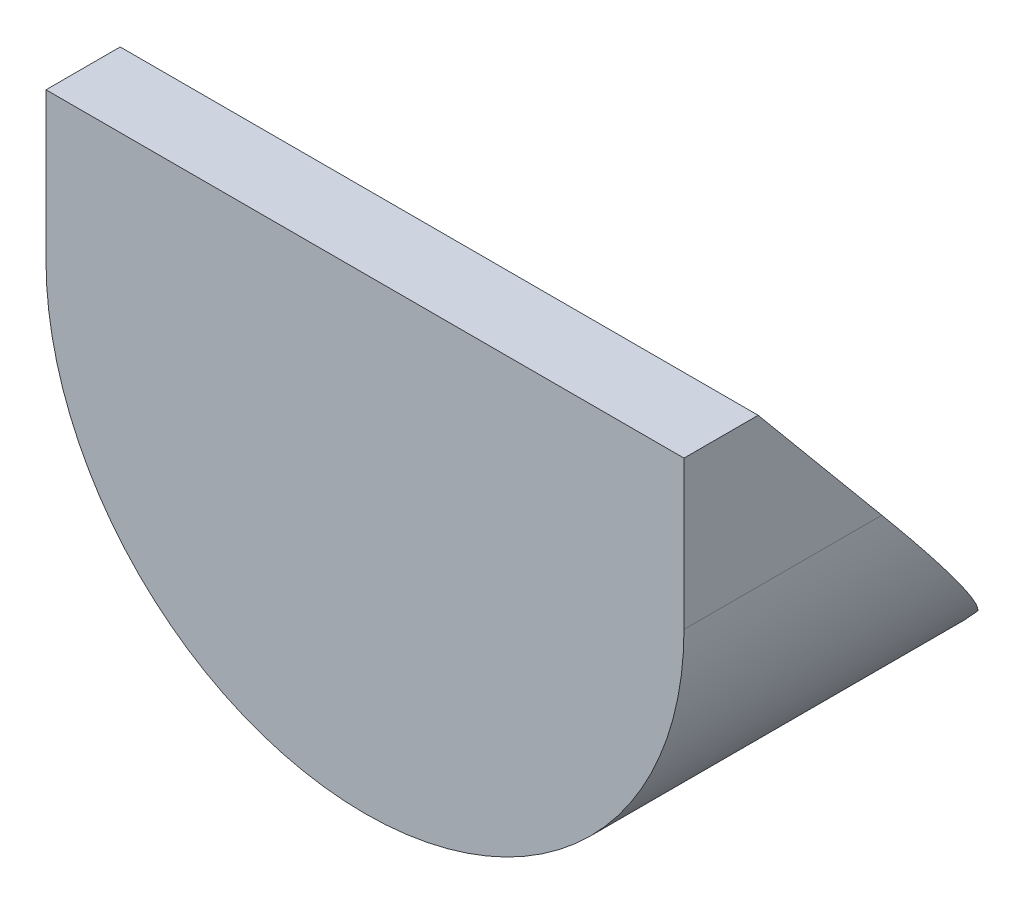
ISO-10303-21;
HEADER;
FILE_DESCRIPTION(('STEP AP214'),'2;1');
FILE_NAME('part.step','',(''),(''),'','','');
FILE_SCHEMA(('AUTOMOTIVE_DESIGN { 1 0 10303 214 1 1 1 1 }'));
ENDSEC;
DATA;
#1=APPLICATION_CONTEXT('core data for automotive mechanical design processes');
#2=APPLICATION_PROTOCOL_DEFINITION('international standard','automotive_design',2000,#1);
#3=PRODUCT_CONTEXT('',#1,'mechanical');
#4=PRODUCT('Part','Part','',(#3));
#5=PRODUCT_RELATED_PRODUCT_CATEGORY('part','',(#4));
#6=PRODUCT_DEFINITION_FORMATION('','',#4);
#7=PRODUCT_DEFINITION_CONTEXT('part definition',#1,'design');
#8=PRODUCT_DEFINITION('design','',#6,#7);
#9=PRODUCT_DEFINITION_SHAPE('','',#8);
#10=(LENGTH_UNIT() NAMED_UNIT(*) SI_UNIT(.MILLI.,.METRE.));
#11=(NAMED_UNIT(*) PLANE_ANGLE_UNIT() SI_UNIT($,.RADIAN.));
#12=(NAMED_UNIT(*) SI_UNIT($,.STERADIAN.) SOLID_ANGLE_UNIT());
#13=UNCERTAINTY_MEASURE_WITH_UNIT(LENGTH_MEASURE(1.E-05),#10,'distance_accuracy_value','');
#14=(GEOMETRIC_REPRESENTATION_CONTEXT(3) GLOBAL_UNCERTAINTY_ASSIGNED_CONTEXT((#13)) GLOBAL_UNIT_ASSIGNED_CONTEXT((#10,
#11,#12)) REPRESENTATION_CONTEXT('',''));
#15=CARTESIAN_POINT('',(0.,0.,0.));
#16=DIRECTION('',(0.,0.,1.));
#17=DIRECTION('',(1.,0.,0.));
#18=AXIS2_PLACEMENT_3D('',#15,#16,#17);
#19=CARTESIAN_POINT('',(86.,20.,50.));
#20=DIRECTION('',(0.,-1.,0.));
#21=DIRECTION('',(1.,0.,0.));
#22=AXIS2_PLACEMENT_3D('',#19,#20,#21);
#23=PLANE('',#22);
#24=DIRECTION('',(0.,0.,-1.));
#25=VECTOR('',#24,1.);
#26=CARTESIAN_POINT('',(86.,20.,50.));
#27=LINE('',#26,#25);
#28=CARTESIAN_POINT('',(86.,20.,50.));
#29=VERTEX_POINT('',#28);
#30=CARTESIAN_POINT('',(86.,20.,40.));
#31=VERTEX_POINT('',#30);
#32=EDGE_CURVE('E101',#29,#31,#27,.T.);
#33=ORIENTED_EDGE('',*,*,#32,.T.);
#34=DIRECTION('',(1.,0.,0.));
#35=VECTOR('',#34,1.);
#36=CARTESIAN_POINT('',(-1.2E-05,20.,40.));
#37=LINE('',#36,#35);
#38=CARTESIAN_POINT('',(0.,20.,40.));
#39=VERTEX_POINT('',#38);
#40=EDGE_CURVE('E86',#39,#31,#37,.T.);
#41=ORIENTED_EDGE('',*,*,#40,.F.);
#42=DIRECTION('',(0.,0.,-1.));
#43=VECTOR('',#42,1.);
#44=CARTESIAN_POINT('',(0.,20.,50.));
#45=LINE('',#44,#43);
#46=CARTESIAN_POINT('',(0.,20.,50.));
#47=VERTEX_POINT('',#46);
#48=EDGE_CURVE('E118',#47,#39,#45,.T.);
#49=ORIENTED_EDGE('',*,*,#48,.F.);
#50=DIRECTION('',(-1.,0.,0.));
#51=VECTOR('',#50,1.);
#52=CARTESIAN_POINT('',(86.,20.,50.));
#53=LINE('',#52,#51);
#54=EDGE_CURVE('E107',#29,#47,#53,.T.);
#55=ORIENTED_EDGE('',*,*,#54,.F.);
#56=EDGE_LOOP('',(#33,#41,#49,#55));
#57=FACE_BOUND('',#56,.T.);
#58=ADVANCED_FACE('F37',(#57),#23,.F.);
#59=CARTESIAN_POINT('',(0.,20.,50.));
#60=DIRECTION('',(1.,0.,0.));
#61=DIRECTION('',(0.,0.,-1.));
#62=AXIS2_PLACEMENT_3D('',#59,#60,#61);
#63=PLANE('',#62);
#64=ORIENTED_EDGE('',*,*,#48,.T.);
#65=DIRECTION('',(0.,-0.768221279597376,-0.64018439966448));
#66=VECTOR('',#65,1.);
#67=CARTESIAN_POINT('',(0.,24.9180327868852,44.0983606557377));
#68=LINE('',#67,#66);
#69=CARTESIAN_POINT('',(0.,0.,23.3333333333333));
#70=VERTEX_POINT('',#69);
#71=EDGE_CURVE('E91',#39,#70,#68,.T.);
#72=ORIENTED_EDGE('',*,*,#71,.T.);
#73=DIRECTION('',(0.,0.,-1.));
#74=VECTOR('',#73,1.);
#75=CARTESIAN_POINT('',(0.,0.,50.));
#76=LINE('',#75,#74);
#77=CARTESIAN_POINT('',(0.,0.,50.));
#78=VERTEX_POINT('',#77);
#79=EDGE_CURVE('E109',#78,#70,#76,.T.);
#80=ORIENTED_EDGE('',*,*,#79,.F.);
#81=DIRECTION('',(0.,-1.,0.));
#82=VECTOR('',#81,1.);
#83=CARTESIAN_POINT('',(0.,20.,50.));
#84=LINE('',#83,#82);
#85=EDGE_CURVE('E126',#47,#78,#84,.T.);
#86=ORIENTED_EDGE('',*,*,#85,.F.);
#87=EDGE_LOOP('',(#64,#72,#80,#86));
#88=FACE_BOUND('',#87,.T.);
#89=ADVANCED_FACE('F136',(#88),#63,.F.);
#90=CARTESIAN_POINT('',(43.,0.,50.));
#91=DIRECTION('',(0.,0.,-1.));
#92=DIRECTION('',(-1.,0.,0.));
#93=AXIS2_PLACEMENT_3D('',#90,#91,#92);
#94=CYLINDRICAL_SURFACE('',#93,43.);
#95=CARTESIAN_POINT('',(43.,-43.,36.));
#96=CARTESIAN_POINT('',(42.8877242564101,-42.9999993767985,36.0000049584662));
#97=CARTESIAN_POINT('',(42.7753686492771,-42.9995555500607,36.0094861315674));
#98=CARTESIAN_POINT('',(42.5537562331925,-42.9978277046776,36.047174341304));
#99=CARTESIAN_POINT('',(42.4445032452205,-42.99654269324,36.0754035054758));
#100=CARTESIAN_POINT('',(42.2323384539141,-42.9932779375306,36.1497783373571));
#101=CARTESIAN_POINT('',(42.1294234765363,-42.9912985443828,36.1959149511642));
#102=CARTESIAN_POINT('',(41.9328269639595,-42.9868680250333,36.3047813117587));
#103=CARTESIAN_POINT('',(41.8391432407413,-42.9844170110251,36.3675071134796));
#104=CARTESIAN_POINT('',(41.6635567666607,-42.9793165792128,36.5078340645806));
#105=CARTESIAN_POINT('',(41.5816632502008,-42.9766670083366,36.5854467640075));
#106=CARTESIAN_POINT('',(41.4320604268245,-42.971469409735,36.7533216183235));
#107=CARTESIAN_POINT('',(41.3643516962245,-42.9689213861387,36.8435842869222));
#108=CARTESIAN_POINT('',(41.2450161674242,-42.9642131646773,37.0342437789067));
#109=CARTESIAN_POINT('',(41.1933964004605,-42.9620531365491,37.1346450077638));
#110=CARTESIAN_POINT('',(41.1077492584062,-42.9583663024742,37.3427005458561));
#111=CARTESIAN_POINT('',(41.0737217630934,-42.9568394922001,37.4503548055199));
#112=CARTESIAN_POINT('',(41.0242489896094,-42.9545926210171,37.6697771589168));
#113=CARTESIAN_POINT('',(41.0087901550679,-42.9538719715829,37.7815421899962));
#114=CARTESIAN_POINT('',(40.9968517041812,-42.9533169188948,38.0060830388593));
#115=CARTESIAN_POINT('',(41.0003719536469,-42.9534825093748,38.1188588494908));
#116=CARTESIAN_POINT('',(41.0262804336003,-42.9546807159793,38.3421278700973));
#117=CARTESIAN_POINT('',(41.0486540200577,-42.9557126591757,38.4526227834993));
#118=CARTESIAN_POINT('',(41.1116113826346,-42.9585261970236,38.66828676782));
#119=CARTESIAN_POINT('',(41.1521952279711,-42.9603077945245,38.7734558184933));
#120=CARTESIAN_POINT('',(41.2504378271579,-42.9644206080422,38.975529906416));
#121=CARTESIAN_POINT('',(41.3081032652024,-42.9667520391412,39.0724316894481));
#122=CARTESIAN_POINT('',(41.4388672589231,-42.9717015147902,39.2551849519029));
#123=CARTESIAN_POINT('',(41.5119659080312,-42.9743195610752,39.3410363644221));
#124=CARTESIAN_POINT('',(41.6716039998609,-42.9795501686405,39.4993371228907));
#125=CARTESIAN_POINT('',(41.758156126279,-42.9821627223621,39.5717736788593));
#126=CARTESIAN_POINT('',(41.9421996689876,-42.9870854803401,39.7010899803291));
#127=CARTESIAN_POINT('',(42.0396910877431,-42.9893956845284,39.7579697223248));
#128=CARTESIAN_POINT('',(42.242853200977,-42.99345345342,39.8545565239183));
#129=CARTESIAN_POINT('',(42.3485241035732,-42.9952010038015,39.8942631463959));
#130=CARTESIAN_POINT('',(42.5650422854819,-42.9979362922093,39.9553682657021));
#131=CARTESIAN_POINT('',(42.6758895312299,-42.9989240351617,39.9767668812266));
#132=CARTESIAN_POINT('',(42.8995027990344,-43.0000277511447,40.0006328142745));
#133=CARTESIAN_POINT('',(43.0122669289568,-43.0001445388965,40.0031178242754));
#134=CARTESIAN_POINT('',(43.236610616052,-42.9994953438824,39.9891321638379));
#135=CARTESIAN_POINT('',(43.3481901766049,-42.9987293636362,39.9726615475064));
#136=CARTESIAN_POINT('',(43.5669478705797,-42.9964014424201,39.9212468177335));
#137=CARTESIAN_POINT('',(43.6741279044643,-42.9948398491255,39.8863107732573));
#138=CARTESIAN_POINT('',(43.881102605436,-42.9910965478461,39.7989650727381));
#139=CARTESIAN_POINT('',(43.9808972357906,-42.9889148367773,39.7465553297939));
#140=CARTESIAN_POINT('',(44.1703496103459,-42.9841747728929,39.6257045970123));
#141=CARTESIAN_POINT('',(44.2599997755801,-42.9816161417214,39.5572517370388));
#142=CARTESIAN_POINT('',(44.4265421959993,-42.9764113614936,39.406275255405));
#143=CARTESIAN_POINT('',(44.5034343797428,-42.9737652119474,39.3237515549569));
#144=CARTESIAN_POINT('',(44.642337620421,-42.9686813354286,39.1468998834676));
#145=CARTESIAN_POINT('',(44.7043372373221,-42.9662437696033,39.0525629219114));
#146=CARTESIAN_POINT('',(44.8116172218029,-42.9618544535973,38.8548081068503));
#147=CARTESIAN_POINT('',(44.8568976548109,-42.9599027015154,38.7513902888839));
#148=CARTESIAN_POINT('',(44.9294339506676,-42.9567062455671,38.5384519400315));
#149=CARTESIAN_POINT('',(44.9566971290342,-42.9554612547646,38.4289339056157));
#150=CARTESIAN_POINT('',(44.9924489498096,-42.9538179021939,38.2068689317119));
#151=CARTESIAN_POINT('',(45.0009376797989,-42.9534195364763,38.0943220063557));
#152=CARTESIAN_POINT('',(44.9988987845371,-42.9535144575814,37.8695079825817));
#153=CARTESIAN_POINT('',(44.9883891611461,-42.9540069003201,37.7572407200975));
#154=CARTESIAN_POINT('',(44.9486890702562,-42.9558261516465,37.5360662773771));
#155=CARTESIAN_POINT('',(44.9194985668031,-42.9571529618401,37.4271591036083));
#156=CARTESIAN_POINT('',(44.8432688733544,-42.9604912167051,37.2157921900825));
#157=CARTESIAN_POINT('',(44.7962295059183,-42.9625026681828,37.1133325144336));
#158=CARTESIAN_POINT('',(44.6856407408087,-42.966983421325,36.9177643429577));
#159=CARTESIAN_POINT('',(44.6220918686826,-42.9694527084146,36.8246555495945));
#160=CARTESIAN_POINT('',(44.4802245248299,-42.9745734538168,36.650342865364));
#161=CARTESIAN_POINT('',(44.4018937096951,-42.9772250631897,36.5691490253288));
#162=CARTESIAN_POINT('',(44.2326902514085,-42.9824106232451,36.4210391281147));
#163=CARTESIAN_POINT('',(44.1418145234324,-42.9849445447824,36.3541265930789));
#164=CARTESIAN_POINT('',(43.9500371339608,-42.9896107413021,36.2364516577984));
#165=CARTESIAN_POINT('',(43.8491265988517,-42.9917426558849,36.1857037213113));
#166=CARTESIAN_POINT('',(43.6402836324688,-42.9953590354295,36.1019308315624));
#167=CARTESIAN_POINT('',(43.5323596825554,-42.9968442662808,36.0688849024651));
#168=CARTESIAN_POINT('',(43.3531356692763,-42.9986062159747,36.0301409694973));
#169=CARTESIAN_POINT('',(43.2829970060346,-42.9991265941333,36.0188524922293));
#170=CARTESIAN_POINT('',(43.1419161993403,-42.9998236829957,36.0037804430032));
#171=CARTESIAN_POINT('',(43.0709740564757,-43.000000393951,35.9999968655522));
#172=CARTESIAN_POINT('',(43.,-43.,36.));
#173=B_SPLINE_CURVE_WITH_KNOTS('',3,(#95,#96,#97,#98,#99,#100,#101,#102,#103,#104,#105,#106,
#107,#108,#109,#110,#111,#112,#113,#114,#115,#116,#117,#118,#119,#120,#121,#122,#123,#124,#125,
#126,#127,#128,#129,#130,#131,#132,#133,#134,#135,#136,#137,#138,#139,#140,#141,#142,#143,#144,
#145,#146,#147,#148,#149,#150,#151,#152,#153,#154,#155,#156,#157,#158,#159,#160,#161,#162,#163,
#164,#165,#166,#167,#168,#169,#170,#171,#172),.UNSPECIFIED.,.T.,.F.,(4,2,2,2,2,2,2,2,2,2,2,2,2,
2,2,2,2,2,2,2,2,2,2,2,2,2,2,2,2,2,2,2,2,2,2,2,2,2,4),(0.,0.336568152659357,0.673534251454479,
1.0103302036053,1.3470461343845,1.68402437178397,2.02101629768472,2.35815529075697,
2.69529197985718,3.03218238662831,3.36907041146259,3.70569700481107,4.04232487768322,
4.37908465073693,4.71584646257587,5.05292771494628,5.390009043277,5.72709895108716,
6.06418667343586,6.40095903281607,6.73773043091758,7.07435478922272,7.41098082167395,
7.74785671094531,8.08473448657017,8.4218702201356,8.75900463435297,9.09600207817034,
9.43299794993285,9.76967466914322,10.1063520363393,10.443032750625,10.7797027486586,
11.1166551312537,11.453690519338,11.7910266382327,12.1279621445113,12.3407206958675,
12.5534790915013),.UNSPECIFIED.);
#174=CARTESIAN_POINT('',(43.,-43.,36.));
#175=VERTEX_POINT('',#174);
#176=EDGE_CURVE('E11',#175,#175,#173,.T.);
#177=ORIENTED_EDGE('',*,*,#176,.T.);
#178=EDGE_LOOP('',(#177));
#179=FACE_BOUND('',#178,.T.);
#180=CARTESIAN_POINT('',(43.,0.,0.));
#181=DIRECTION('',(0.,0.,1.));
#182=DIRECTION('',(1.,0.,0.));
#183=AXIS2_PLACEMENT_3D('',#180,#181,#182);
#184=CIRCLE('',#183,43.);
#185=CARTESIAN_POINT('',(10.3656622558386,-28.,0.));
#186=VERTEX_POINT('',#185);
#187=CARTESIAN_POINT('',(75.6343377441614,-28.,0.));
#188=VERTEX_POINT('',#187);
#189=EDGE_CURVE('E114',#186,#188,#184,.T.);
#190=ORIENTED_EDGE('',*,*,#189,.T.);
#191=CARTESIAN_POINT('',(43.,0.,23.3333333333333));
#192=DIRECTION('',(0.,-0.64018439966448,0.768221279597376));
#193=DIRECTION('',(0.,-0.768221279597376,-0.64018439966448));
#194=AXIS2_PLACEMENT_3D('',#191,#192,#193);
#195=ELLIPSE('',#194,55.9734560106643,43.);
#196=CARTESIAN_POINT('',(86.,0.,23.3333333333333));
#197=VERTEX_POINT('',#196);
#198=EDGE_CURVE('E55',#188,#197,#195,.T.);
#199=ORIENTED_EDGE('',*,*,#198,.T.);
#200=DIRECTION('',(0.,0.,-1.));
#201=VECTOR('',#200,1.);
#202=CARTESIAN_POINT('',(86.,0.,50.));
#203=LINE('',#202,#201);
#204=CARTESIAN_POINT('',(86.,0.,50.));
#205=VERTEX_POINT('',#204);
#206=EDGE_CURVE('E104',#205,#197,#203,.T.);
#207=ORIENTED_EDGE('',*,*,#206,.F.);
#208=CARTESIAN_POINT('',(43.,0.,50.));
#209=DIRECTION('',(0.,0.,1.));
#210=DIRECTION('',(1.,0.,0.));
#211=AXIS2_PLACEMENT_3D('',#208,#209,#210);
#212=CIRCLE('',#211,43.);
#213=EDGE_CURVE('E111',#78,#205,#212,.T.);
#214=ORIENTED_EDGE('',*,*,#213,.F.);
#215=ORIENTED_EDGE('',*,*,#79,.T.);
#216=EDGE_CURVE('E96',#70,#186,#195,.T.);
#217=ORIENTED_EDGE('',*,*,#216,.T.);
#218=EDGE_LOOP('',(#190,#199,#207,#214,#215,#217));
#219=FACE_BOUND('',#218,.T.);
#220=ADVANCED_FACE('F125',(#179,#219),#94,.T.);
#221=CARTESIAN_POINT('',(86.,0.,50.));
#222=DIRECTION('',(-1.,0.,0.));
#223=DIRECTION('',(0.,0.,1.));
#224=AXIS2_PLACEMENT_3D('',#221,#222,#223);
#225=PLANE('',#224);
#226=ORIENTED_EDGE('',*,*,#206,.T.);
#227=DIRECTION('',(0.,-0.768221279597376,-0.64018439966448));
#228=VECTOR('',#227,1.);
#229=CARTESIAN_POINT('',(86.,20.,40.));
#230=LINE('',#229,#228);
#231=EDGE_CURVE('E89',#31,#197,#230,.T.);
#232=ORIENTED_EDGE('',*,*,#231,.F.);
#233=ORIENTED_EDGE('',*,*,#32,.F.);
#234=DIRECTION('',(0.,1.,0.));
#235=VECTOR('',#234,1.);
#236=CARTESIAN_POINT('',(86.,0.,50.));
#237=LINE('',#236,#235);
#238=EDGE_CURVE('E63',#205,#29,#237,.T.);
#239=ORIENTED_EDGE('',*,*,#238,.F.);
#240=EDGE_LOOP('',(#226,#232,#233,#239));
#241=FACE_BOUND('',#240,.T.);
#242=ADVANCED_FACE('F100',(#241),#225,.F.);
#243=CARTESIAN_POINT('',(43.,0.,50.));
#244=DIRECTION('',(0.,0.,1.));
#245=DIRECTION('',(1.,0.,0.));
#246=AXIS2_PLACEMENT_3D('',#243,#244,#245);
#247=PLANE('',#246);
#248=ORIENTED_EDGE('',*,*,#54,.T.);
#249=ORIENTED_EDGE('',*,*,#85,.T.);
#250=ORIENTED_EDGE('',*,*,#213,.T.);
#251=ORIENTED_EDGE('',*,*,#238,.T.);
#252=EDGE_LOOP('',(#248,#249,#250,#251));
#253=FACE_BOUND('',#252,.T.);
#254=ADVANCED_FACE('F133',(#253),#247,.T.);
#255=CARTESIAN_POINT('',(43.,0.,0.));
#256=DIRECTION('',(0.,0.,1.));
#257=DIRECTION('',(1.,0.,0.));
#258=AXIS2_PLACEMENT_3D('',#255,#256,#257);
#259=PLANE('',#258);
#260=ORIENTED_EDGE('',*,*,#189,.F.);
#261=DIRECTION('',(1.,0.,0.));
#262=VECTOR('',#261,1.);
#263=CARTESIAN_POINT('',(43.,-28.,0.));
#264=LINE('',#263,#262);
#265=EDGE_CURVE('E48',#186,#188,#264,.T.);
#266=ORIENTED_EDGE('',*,*,#265,.T.);
#267=EDGE_LOOP('',(#260,#266));
#268=FACE_BOUND('',#267,.T.);
#269=ADVANCED_FACE('F122',(#268),#259,.F.);
#270=CARTESIAN_POINT('',(-1.2E-05,20.,40.));
#271=DIRECTION('',(0.,-0.64018439966448,0.768221279597376));
#272=DIRECTION('',(0.,-0.768221279597376,-0.64018439966448));
#273=AXIS2_PLACEMENT_3D('',#270,#271,#272);
#274=PLANE('',#273);
#275=ORIENTED_EDGE('',*,*,#265,.F.);
#276=ORIENTED_EDGE('',*,*,#216,.F.);
#277=ORIENTED_EDGE('',*,*,#71,.F.);
#278=ORIENTED_EDGE('',*,*,#40,.T.);
#279=ORIENTED_EDGE('',*,*,#231,.T.);
#280=ORIENTED_EDGE('',*,*,#198,.F.);
#281=EDGE_LOOP('',(#275,#276,#277,#278,#279,#280));
#282=FACE_BOUND('',#281,.T.);
#283=ADVANCED_FACE('F88',(#282),#274,.F.);
#284=CARTESIAN_POINT('',(43.,-23.,38.));
#285=DIRECTION('',(0.,-1.,0.));
#286=DIRECTION('',(0.,0.,-1.));
#287=AXIS2_PLACEMENT_3D('',#284,#285,#286);
#288=CYLINDRICAL_SURFACE('',#287,2.);
#289=CARTESIAN_POINT('',(43.,-23.,38.));
#290=DIRECTION('',(0.,-1.,0.));
#291=DIRECTION('',(0.,0.,-1.));
#292=AXIS2_PLACEMENT_3D('',#289,#290,#291);
#293=CIRCLE('',#292,2.);
#294=CARTESIAN_POINT('',(43.,-23.,36.));
#295=VERTEX_POINT('',#294);
#296=EDGE_CURVE('E105',#295,#295,#293,.T.);
#297=ORIENTED_EDGE('',*,*,#296,.F.);
#298=EDGE_LOOP('',(#297));
#299=FACE_BOUND('',#298,.T.);
#300=ORIENTED_EDGE('',*,*,#176,.F.);
#301=EDGE_LOOP('',(#300));
#302=FACE_BOUND('',#301,.T.);
#303=ADVANCED_FACE('F152',(#299,#302),#288,.F.);
#304=CARTESIAN_POINT('',(43.,-23.,38.));
#305=DIRECTION('',(0.,-1.,0.));
#306=DIRECTION('',(0.,0.,-1.));
#307=AXIS2_PLACEMENT_3D('',#304,#305,#306);
#308=PLANE('',#307);
#309=ORIENTED_EDGE('',*,*,#296,.T.);
#310=EDGE_LOOP('',(#309));
#311=FACE_BOUND('',#310,.T.);
#312=ADVANCED_FACE('F156',(#311),#308,.T.);
#313=CLOSED_SHELL('',(#58,#89,#220,#242,#254,#269,#283,#303,#312));
#314=MANIFOLD_SOLID_BREP('B2',#313);
#315=ADVANCED_BREP_SHAPE_REPRESENTATION('',(#18,#314),#14);
#316=SHAPE_DEFINITION_REPRESENTATION(#9,#315);
ENDSEC;
END-ISO-10303-21;
